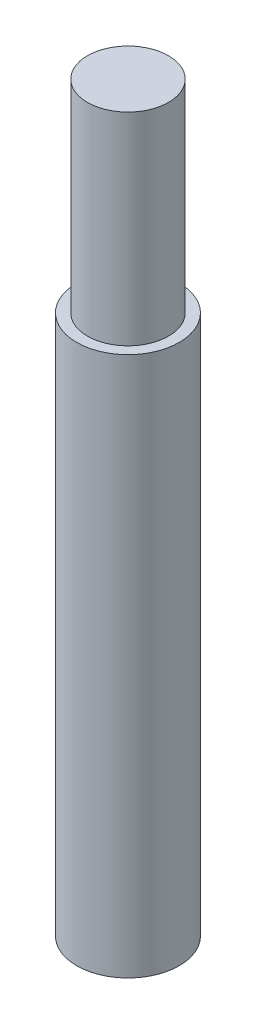
ISO-10303-21;
HEADER;
FILE_DESCRIPTION(('STEP AP214'),'2;1');
FILE_NAME('part.step','',(''),(''),'','','');
FILE_SCHEMA(('AUTOMOTIVE_DESIGN { 1 0 10303 214 1 1 1 1 }'));
ENDSEC;
DATA;
#1=APPLICATION_CONTEXT('core data for automotive mechanical design processes');
#2=APPLICATION_PROTOCOL_DEFINITION('international standard','automotive_design',2000,#1);
#3=PRODUCT_CONTEXT('',#1,'mechanical');
#4=PRODUCT('Part','Part','',(#3));
#5=PRODUCT_RELATED_PRODUCT_CATEGORY('part','',(#4));
#6=PRODUCT_DEFINITION_FORMATION('','',#4);
#7=PRODUCT_DEFINITION_CONTEXT('part definition',#1,'design');
#8=PRODUCT_DEFINITION('design','',#6,#7);
#9=PRODUCT_DEFINITION_SHAPE('','',#8);
#10=(LENGTH_UNIT() NAMED_UNIT(*) SI_UNIT(.MILLI.,.METRE.));
#11=(NAMED_UNIT(*) PLANE_ANGLE_UNIT() SI_UNIT($,.RADIAN.));
#12=(NAMED_UNIT(*) SI_UNIT($,.STERADIAN.) SOLID_ANGLE_UNIT());
#13=UNCERTAINTY_MEASURE_WITH_UNIT(LENGTH_MEASURE(1.E-05),#10,'distance_accuracy_value','');
#14=(GEOMETRIC_REPRESENTATION_CONTEXT(3) GLOBAL_UNCERTAINTY_ASSIGNED_CONTEXT((#13)) GLOBAL_UNIT_ASSIGNED_CONTEXT((#10,
#11,#12)) REPRESENTATION_CONTEXT('',''));
#15=CARTESIAN_POINT('',(0.,0.,0.));
#16=DIRECTION('',(0.,0.,1.));
#17=DIRECTION('',(1.,0.,0.));
#18=AXIS2_PLACEMENT_3D('',#15,#16,#17);
#19=CARTESIAN_POINT('',(0.,25.4,0.));
#20=DIRECTION('',(0.,-1.,0.));
#21=DIRECTION('',(0.,0.,-1.));
#22=AXIS2_PLACEMENT_3D('',#19,#20,#21);
#23=CYLINDRICAL_SURFACE('',#22,2.413);
#24=CARTESIAN_POINT('',(0.,25.4,0.));
#25=DIRECTION('',(0.,1.,0.));
#26=DIRECTION('',(0.,0.,1.));
#27=AXIS2_PLACEMENT_3D('',#24,#25,#26);
#28=CIRCLE('',#27,2.413);
#29=CARTESIAN_POINT('',(0.,25.4,2.413));
#30=VERTEX_POINT('',#29);
#31=EDGE_CURVE('E44',#30,#30,#28,.T.);
#32=ORIENTED_EDGE('',*,*,#31,.F.);
#33=EDGE_LOOP('',(#32));
#34=FACE_BOUND('',#33,.T.);
#35=CARTESIAN_POINT('',(0.,0.,0.));
#36=DIRECTION('',(0.,1.,0.));
#37=DIRECTION('',(0.,0.,1.));
#38=AXIS2_PLACEMENT_3D('',#35,#36,#37);
#39=CIRCLE('',#38,2.413);
#40=CARTESIAN_POINT('',(0.,0.,2.413));
#41=VERTEX_POINT('',#40);
#42=EDGE_CURVE('E40',#41,#41,#39,.T.);
#43=ORIENTED_EDGE('',*,*,#42,.T.);
#44=EDGE_LOOP('',(#43));
#45=FACE_BOUND('',#44,.T.);
#46=ADVANCED_FACE('F37',(#34,#45),#23,.T.);
#47=CARTESIAN_POINT('',(0.,25.4,0.));
#48=DIRECTION('',(0.,1.,0.));
#49=DIRECTION('',(0.,0.,1.));
#50=AXIS2_PLACEMENT_3D('',#47,#48,#49);
#51=PLANE('',#50);
#52=CARTESIAN_POINT('',(0.,25.4,0.));
#53=DIRECTION('',(0.,1.,0.));
#54=DIRECTION('',(0.,0.,1.));
#55=AXIS2_PLACEMENT_3D('',#52,#53,#54);
#56=CIRCLE('',#55,1.905);
#57=CARTESIAN_POINT('',(0.,25.4,1.905));
#58=VERTEX_POINT('',#57);
#59=EDGE_CURVE('E10',#58,#58,#56,.T.);
#60=ORIENTED_EDGE('',*,*,#59,.F.);
#61=EDGE_LOOP('',(#60));
#62=FACE_BOUND('',#61,.T.);
#63=ORIENTED_EDGE('',*,*,#31,.T.);
#64=EDGE_LOOP('',(#63));
#65=FACE_BOUND('',#64,.T.);
#66=ADVANCED_FACE('F61',(#62,#65),#51,.T.);
#67=CARTESIAN_POINT('',(0.,0.,0.));
#68=DIRECTION('',(0.,1.,0.));
#69=DIRECTION('',(0.,0.,1.));
#70=AXIS2_PLACEMENT_3D('',#67,#68,#69);
#71=PLANE('',#70);
#72=ORIENTED_EDGE('',*,*,#42,.F.);
#73=EDGE_LOOP('',(#72));
#74=FACE_BOUND('',#73,.T.);
#75=ADVANCED_FACE('F58',(#74),#71,.F.);
#76=CARTESIAN_POINT('',(0.,34.925,0.));
#77=DIRECTION('',(0.,-1.,0.));
#78=DIRECTION('',(0.,0.,-1.));
#79=AXIS2_PLACEMENT_3D('',#76,#77,#78);
#80=CYLINDRICAL_SURFACE('',#79,1.905);
#81=CARTESIAN_POINT('',(0.,34.925,0.));
#82=DIRECTION('',(0.,1.,0.));
#83=DIRECTION('',(0.,0.,1.));
#84=AXIS2_PLACEMENT_3D('',#81,#82,#83);
#85=CIRCLE('',#84,1.905);
#86=CARTESIAN_POINT('',(0.,34.925,1.905));
#87=VERTEX_POINT('',#86);
#88=EDGE_CURVE('E50',#87,#87,#85,.T.);
#89=ORIENTED_EDGE('',*,*,#88,.F.);
#90=EDGE_LOOP('',(#89));
#91=FACE_BOUND('',#90,.T.);
#92=ORIENTED_EDGE('',*,*,#59,.T.);
#93=EDGE_LOOP('',(#92));
#94=FACE_BOUND('',#93,.T.);
#95=ADVANCED_FACE('F60',(#91,#94),#80,.T.);
#96=CARTESIAN_POINT('',(0.,34.925,0.));
#97=DIRECTION('',(0.,1.,0.));
#98=DIRECTION('',(0.,0.,1.));
#99=AXIS2_PLACEMENT_3D('',#96,#97,#98);
#100=PLANE('',#99);
#101=ORIENTED_EDGE('',*,*,#88,.T.);
#102=EDGE_LOOP('',(#101));
#103=FACE_BOUND('',#102,.T.);
#104=ADVANCED_FACE('F66',(#103),#100,.T.);
#105=CLOSED_SHELL('',(#46,#66,#75,#95,#104));
#106=MANIFOLD_SOLID_BREP('B2',#105);
#107=ADVANCED_BREP_SHAPE_REPRESENTATION('',(#18,#106),#14);
#108=SHAPE_DEFINITION_REPRESENTATION(#9,#107);
ENDSEC;
END-ISO-10303-21;
